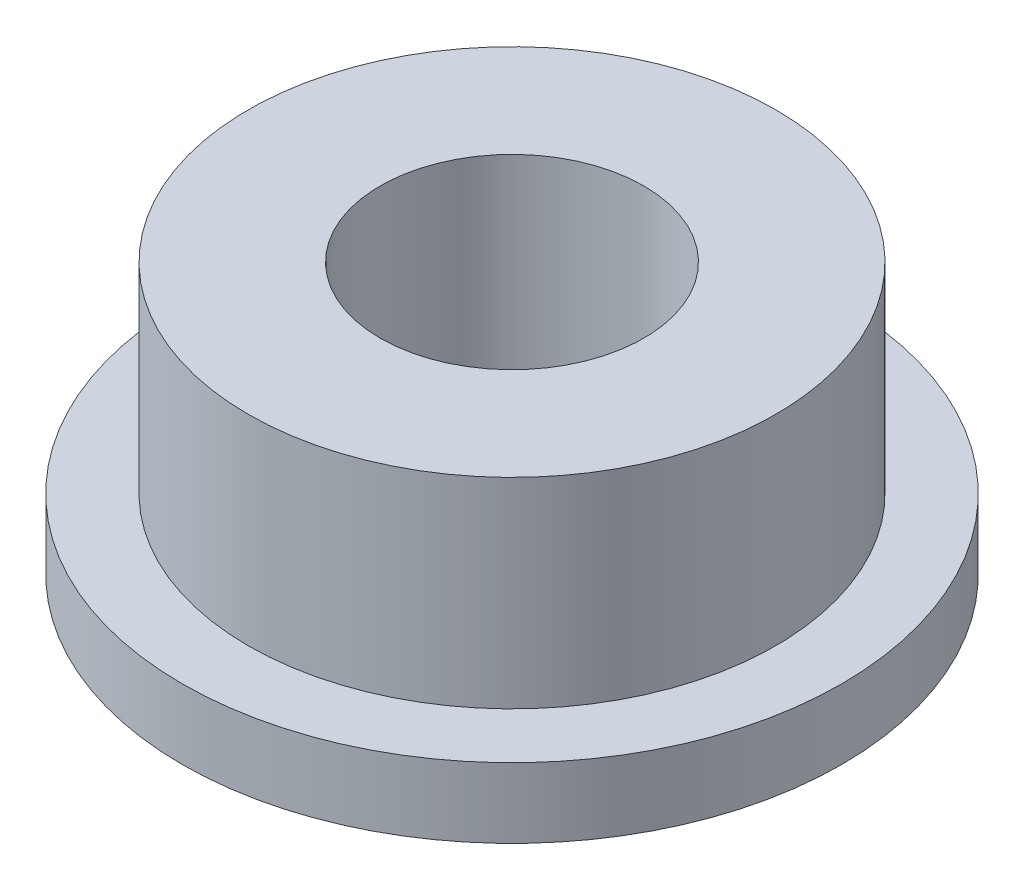
ISO-10303-21;
HEADER;
FILE_DESCRIPTION(('STEP AP214'),'2;1');
FILE_NAME('part.step','',(''),(''),'','','');
FILE_SCHEMA(('AUTOMOTIVE_DESIGN { 1 0 10303 214 1 1 1 1 }'));
ENDSEC;
DATA;
#1=APPLICATION_CONTEXT('core data for automotive mechanical design processes');
#2=APPLICATION_PROTOCOL_DEFINITION('international standard','automotive_design',2000,#1);
#3=PRODUCT_CONTEXT('',#1,'mechanical');
#4=PRODUCT('Part','Part','',(#3));
#5=PRODUCT_RELATED_PRODUCT_CATEGORY('part','',(#4));
#6=PRODUCT_DEFINITION_FORMATION('','',#4);
#7=PRODUCT_DEFINITION_CONTEXT('part definition',#1,'design');
#8=PRODUCT_DEFINITION('design','',#6,#7);
#9=PRODUCT_DEFINITION_SHAPE('','',#8);
#10=(LENGTH_UNIT() NAMED_UNIT(*) SI_UNIT(.MILLI.,.METRE.));
#11=(NAMED_UNIT(*) PLANE_ANGLE_UNIT() SI_UNIT($,.RADIAN.));
#12=(NAMED_UNIT(*) SI_UNIT($,.STERADIAN.) SOLID_ANGLE_UNIT());
#13=UNCERTAINTY_MEASURE_WITH_UNIT(LENGTH_MEASURE(1.E-05),#10,'distance_accuracy_value','');
#14=(GEOMETRIC_REPRESENTATION_CONTEXT(3) GLOBAL_UNCERTAINTY_ASSIGNED_CONTEXT((#13)) GLOBAL_UNIT_ASSIGNED_CONTEXT((#10,
#11,#12)) REPRESENTATION_CONTEXT('',''));
#15=CARTESIAN_POINT('',(0.,0.,0.));
#16=DIRECTION('',(0.,0.,1.));
#17=DIRECTION('',(1.,0.,0.));
#18=AXIS2_PLACEMENT_3D('',#15,#16,#17);
#19=CARTESIAN_POINT('',(0.,0.,0.));
#20=DIRECTION('',(0.,-1.,0.));
#21=DIRECTION('',(0.,0.,-1.));
#22=AXIS2_PLACEMENT_3D('',#19,#20,#21);
#23=CYLINDRICAL_SURFACE('',#22,5.);
#24=CARTESIAN_POINT('',(0.,0.,0.));
#25=DIRECTION('',(0.,-1.,0.));
#26=DIRECTION('',(0.,0.,-1.));
#27=AXIS2_PLACEMENT_3D('',#24,#25,#26);
#28=CIRCLE('',#27,5.);
#29=CARTESIAN_POINT('',(0.,0.,-5.));
#30=VERTEX_POINT('',#29);
#31=EDGE_CURVE('E10',#30,#30,#28,.T.);
#32=ORIENTED_EDGE('',*,*,#31,.F.);
#33=EDGE_LOOP('',(#32));
#34=FACE_BOUND('',#33,.T.);
#35=CARTESIAN_POINT('',(0.,1.06,0.));
#36=DIRECTION('',(0.,-1.,0.));
#37=DIRECTION('',(0.,0.,-1.));
#38=AXIS2_PLACEMENT_3D('',#35,#36,#37);
#39=CIRCLE('',#38,5.);
#40=CARTESIAN_POINT('',(0.,1.06,-5.));
#41=VERTEX_POINT('',#40);
#42=EDGE_CURVE('E68',#41,#41,#39,.T.);
#43=ORIENTED_EDGE('',*,*,#42,.T.);
#44=EDGE_LOOP('',(#43));
#45=FACE_BOUND('',#44,.T.);
#46=ADVANCED_FACE('F41',(#34,#45),#23,.T.);
#47=CARTESIAN_POINT('',(-5.,0.,0.));
#48=DIRECTION('',(0.,1.,0.));
#49=DIRECTION('',(0.,0.,1.));
#50=AXIS2_PLACEMENT_3D('',#47,#48,#49);
#51=PLANE('',#50);
#52=CARTESIAN_POINT('',(0.,0.,0.));
#53=DIRECTION('',(0.,-1.,0.));
#54=DIRECTION('',(0.,0.,-1.));
#55=AXIS2_PLACEMENT_3D('',#52,#53,#54);
#56=CIRCLE('',#55,2.);
#57=CARTESIAN_POINT('',(0.,0.,-2.));
#58=VERTEX_POINT('',#57);
#59=EDGE_CURVE('E48',#58,#58,#56,.T.);
#60=ORIENTED_EDGE('',*,*,#59,.F.);
#61=EDGE_LOOP('',(#60));
#62=FACE_BOUND('',#61,.T.);
#63=ORIENTED_EDGE('',*,*,#31,.T.);
#64=EDGE_LOOP('',(#63));
#65=FACE_BOUND('',#64,.T.);
#66=ADVANCED_FACE('F94',(#62,#65),#51,.F.);
#67=CARTESIAN_POINT('',(0.,0.,0.));
#68=DIRECTION('',(0.,-1.,0.));
#69=DIRECTION('',(0.,0.,-1.));
#70=AXIS2_PLACEMENT_3D('',#67,#68,#69);
#71=CYLINDRICAL_SURFACE('',#70,2.);
#72=CARTESIAN_POINT('',(0.,4.1,0.));
#73=DIRECTION('',(0.,-1.,0.));
#74=DIRECTION('',(0.,0.,-1.));
#75=AXIS2_PLACEMENT_3D('',#72,#73,#74);
#76=CIRCLE('',#75,2.);
#77=CARTESIAN_POINT('',(0.,4.1,-2.));
#78=VERTEX_POINT('',#77);
#79=EDGE_CURVE('E53',#78,#78,#76,.T.);
#80=ORIENTED_EDGE('',*,*,#79,.F.);
#81=EDGE_LOOP('',(#80));
#82=FACE_BOUND('',#81,.T.);
#83=ORIENTED_EDGE('',*,*,#59,.T.);
#84=EDGE_LOOP('',(#83));
#85=FACE_BOUND('',#84,.T.);
#86=ADVANCED_FACE('F89',(#82,#85),#71,.F.);
#87=CARTESIAN_POINT('',(-2.,4.1,0.));
#88=DIRECTION('',(0.,-1.,0.));
#89=DIRECTION('',(0.,0.,-1.));
#90=AXIS2_PLACEMENT_3D('',#87,#88,#89);
#91=PLANE('',#90);
#92=CARTESIAN_POINT('',(0.,4.1,0.));
#93=DIRECTION('',(0.,-1.,0.));
#94=DIRECTION('',(0.,0.,-1.));
#95=AXIS2_PLACEMENT_3D('',#92,#93,#94);
#96=CIRCLE('',#95,4.);
#97=CARTESIAN_POINT('',(0.,4.1,-4.));
#98=VERTEX_POINT('',#97);
#99=EDGE_CURVE('E58',#98,#98,#96,.T.);
#100=ORIENTED_EDGE('',*,*,#99,.F.);
#101=EDGE_LOOP('',(#100));
#102=FACE_BOUND('',#101,.T.);
#103=ORIENTED_EDGE('',*,*,#79,.T.);
#104=EDGE_LOOP('',(#103));
#105=FACE_BOUND('',#104,.T.);
#106=ADVANCED_FACE('F83',(#102,#105),#91,.F.);
#107=CARTESIAN_POINT('',(0.,0.,0.));
#108=DIRECTION('',(0.,-1.,0.));
#109=DIRECTION('',(0.,0.,-1.));
#110=AXIS2_PLACEMENT_3D('',#107,#108,#109);
#111=CYLINDRICAL_SURFACE('',#110,4.);
#112=CARTESIAN_POINT('',(0.,1.06,0.));
#113=DIRECTION('',(0.,-1.,0.));
#114=DIRECTION('',(0.,0.,-1.));
#115=AXIS2_PLACEMENT_3D('',#112,#113,#114);
#116=CIRCLE('',#115,4.);
#117=CARTESIAN_POINT('',(0.,1.06,-4.));
#118=VERTEX_POINT('',#117);
#119=EDGE_CURVE('E64',#118,#118,#116,.T.);
#120=ORIENTED_EDGE('',*,*,#119,.F.);
#121=EDGE_LOOP('',(#120));
#122=FACE_BOUND('',#121,.T.);
#123=ORIENTED_EDGE('',*,*,#99,.T.);
#124=EDGE_LOOP('',(#123));
#125=FACE_BOUND('',#124,.T.);
#126=ADVANCED_FACE('F77',(#122,#125),#111,.T.);
#127=CARTESIAN_POINT('',(-4.,1.06,0.));
#128=DIRECTION('',(0.,-1.,0.));
#129=DIRECTION('',(0.,0.,-1.));
#130=AXIS2_PLACEMENT_3D('',#127,#128,#129);
#131=PLANE('',#130);
#132=ORIENTED_EDGE('',*,*,#42,.F.);
#133=EDGE_LOOP('',(#132));
#134=FACE_BOUND('',#133,.T.);
#135=ORIENTED_EDGE('',*,*,#119,.T.);
#136=EDGE_LOOP('',(#135));
#137=FACE_BOUND('',#136,.T.);
#138=ADVANCED_FACE('F74',(#134,#137),#131,.F.);
#139=CLOSED_SHELL('',(#46,#66,#86,#106,#126,#138));
#140=MANIFOLD_SOLID_BREP('B2',#139);
#141=ADVANCED_BREP_SHAPE_REPRESENTATION('',(#18,#140),#14);
#142=SHAPE_DEFINITION_REPRESENTATION(#9,#141);
ENDSEC;
END-ISO-10303-21;
